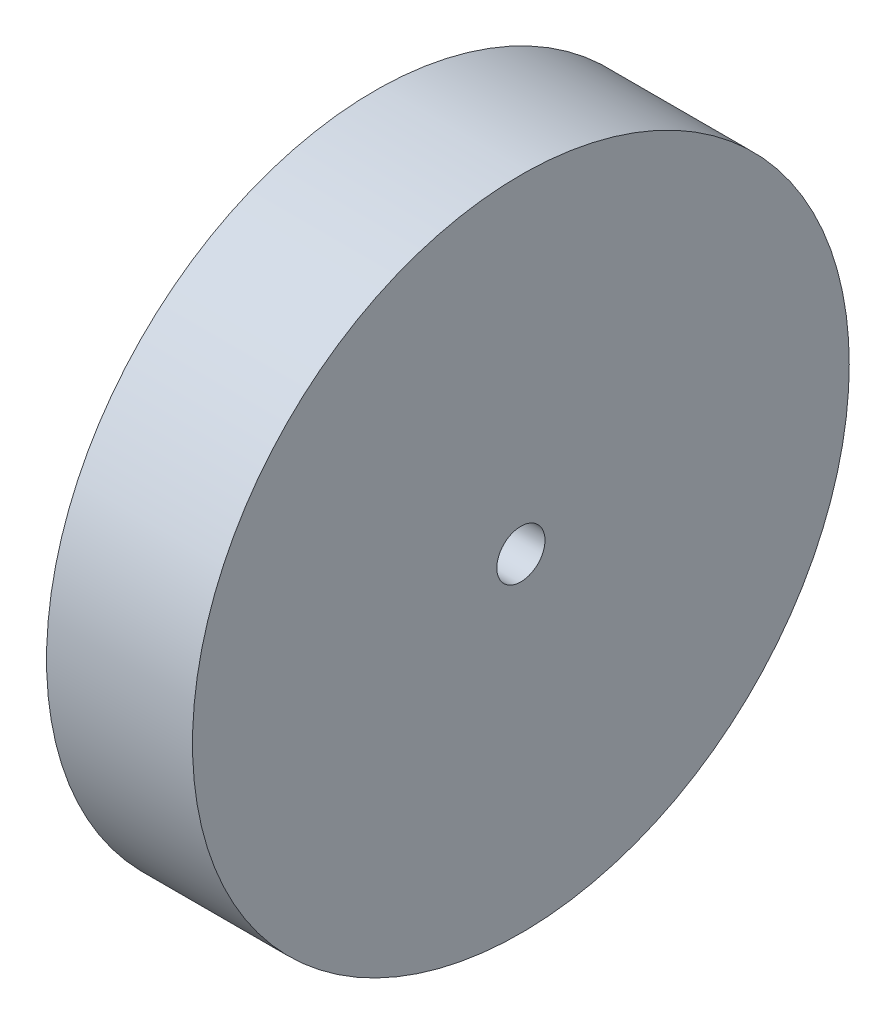
ISO-10303-21;
HEADER;
FILE_DESCRIPTION(('STEP AP214'),'2;1');
FILE_NAME('part.step','',(''),(''),'','','');
FILE_SCHEMA(('AUTOMOTIVE_DESIGN { 1 0 10303 214 1 1 1 1 }'));
ENDSEC;
DATA;
#1=APPLICATION_CONTEXT('core data for automotive mechanical design processes');
#2=APPLICATION_PROTOCOL_DEFINITION('international standard','automotive_design',2000,#1);
#3=PRODUCT_CONTEXT('',#1,'mechanical');
#4=PRODUCT('Part','Part','',(#3));
#5=PRODUCT_RELATED_PRODUCT_CATEGORY('part','',(#4));
#6=PRODUCT_DEFINITION_FORMATION('','',#4);
#7=PRODUCT_DEFINITION_CONTEXT('part definition',#1,'design');
#8=PRODUCT_DEFINITION('design','',#6,#7);
#9=PRODUCT_DEFINITION_SHAPE('','',#8);
#10=(LENGTH_UNIT() NAMED_UNIT(*) SI_UNIT(.MILLI.,.METRE.));
#11=(NAMED_UNIT(*) PLANE_ANGLE_UNIT() SI_UNIT($,.RADIAN.));
#12=(NAMED_UNIT(*) SI_UNIT($,.STERADIAN.) SOLID_ANGLE_UNIT());
#13=UNCERTAINTY_MEASURE_WITH_UNIT(LENGTH_MEASURE(1.E-05),#10,'distance_accuracy_value','');
#14=(GEOMETRIC_REPRESENTATION_CONTEXT(3) GLOBAL_UNCERTAINTY_ASSIGNED_CONTEXT((#13)) GLOBAL_UNIT_ASSIGNED_CONTEXT((#10,
#11,#12)) REPRESENTATION_CONTEXT('',''));
#15=CARTESIAN_POINT('',(0.,0.,0.));
#16=DIRECTION('',(0.,0.,1.));
#17=DIRECTION('',(1.,0.,0.));
#18=AXIS2_PLACEMENT_3D('',#15,#16,#17);
#19=CARTESIAN_POINT('',(16.9333333333333,0.,0.));
#20=DIRECTION('',(-1.,0.,0.));
#21=DIRECTION('',(0.,0.,1.));
#22=AXIS2_PLACEMENT_3D('',#19,#20,#21);
#23=CYLINDRICAL_SURFACE('',#22,38.1);
#24=CARTESIAN_POINT('',(16.9333333333333,0.,0.));
#25=DIRECTION('',(1.,0.,0.));
#26=DIRECTION('',(0.,0.,-1.));
#27=AXIS2_PLACEMENT_3D('',#24,#25,#26);
#28=CIRCLE('',#27,38.1);
#29=CARTESIAN_POINT('',(16.9333333333333,0.,-38.1));
#30=VERTEX_POINT('',#29);
#31=EDGE_CURVE('E10',#30,#30,#28,.T.);
#32=ORIENTED_EDGE('',*,*,#31,.F.);
#33=EDGE_LOOP('',(#32));
#34=FACE_BOUND('',#33,.T.);
#35=CARTESIAN_POINT('',(0.,0.,0.));
#36=DIRECTION('',(1.,0.,0.));
#37=DIRECTION('',(0.,0.,-1.));
#38=AXIS2_PLACEMENT_3D('',#35,#36,#37);
#39=CIRCLE('',#38,38.1);
#40=CARTESIAN_POINT('',(0.,0.,-38.1));
#41=VERTEX_POINT('',#40);
#42=EDGE_CURVE('E36',#41,#41,#39,.T.);
#43=ORIENTED_EDGE('',*,*,#42,.T.);
#44=EDGE_LOOP('',(#43));
#45=FACE_BOUND('',#44,.T.);
#46=ADVANCED_FACE('F33',(#34,#45),#23,.T.);
#47=CARTESIAN_POINT('',(16.9333333333333,0.,0.));
#48=DIRECTION('',(1.,0.,0.));
#49=DIRECTION('',(0.,0.,-1.));
#50=AXIS2_PLACEMENT_3D('',#47,#48,#49);
#51=PLANE('',#50);
#52=CARTESIAN_POINT('',(16.9333333333333,0.,0.));
#53=DIRECTION('',(1.,0.,0.));
#54=DIRECTION('',(0.,0.,-1.));
#55=AXIS2_PLACEMENT_3D('',#52,#53,#54);
#56=CIRCLE('',#55,2.794);
#57=CARTESIAN_POINT('',(16.9333333333333,0.,-2.794));
#58=VERTEX_POINT('',#57);
#59=EDGE_CURVE('E45',#58,#58,#56,.T.);
#60=ORIENTED_EDGE('',*,*,#59,.F.);
#61=EDGE_LOOP('',(#60));
#62=FACE_BOUND('',#61,.T.);
#63=ORIENTED_EDGE('',*,*,#31,.T.);
#64=EDGE_LOOP('',(#63));
#65=FACE_BOUND('',#64,.T.);
#66=ADVANCED_FACE('F60',(#62,#65),#51,.T.);
#67=CARTESIAN_POINT('',(0.,0.,0.));
#68=DIRECTION('',(1.,0.,0.));
#69=DIRECTION('',(0.,0.,-1.));
#70=AXIS2_PLACEMENT_3D('',#67,#68,#69);
#71=PLANE('',#70);
#72=CARTESIAN_POINT('',(0.,0.,0.));
#73=DIRECTION('',(1.,0.,0.));
#74=DIRECTION('',(0.,0.,-1.));
#75=AXIS2_PLACEMENT_3D('',#72,#73,#74);
#76=CIRCLE('',#75,2.794);
#77=CARTESIAN_POINT('',(0.,0.,-2.794));
#78=VERTEX_POINT('',#77);
#79=EDGE_CURVE('E43',#78,#78,#76,.T.);
#80=ORIENTED_EDGE('',*,*,#79,.T.);
#81=EDGE_LOOP('',(#80));
#82=FACE_BOUND('',#81,.T.);
#83=ORIENTED_EDGE('',*,*,#42,.F.);
#84=EDGE_LOOP('',(#83));
#85=FACE_BOUND('',#84,.T.);
#86=ADVANCED_FACE('F51',(#82,#85),#71,.F.);
#87=CARTESIAN_POINT('',(0.,0.,0.));
#88=DIRECTION('',(1.,0.,0.));
#89=DIRECTION('',(0.,0.,-1.));
#90=AXIS2_PLACEMENT_3D('',#87,#88,#89);
#91=CYLINDRICAL_SURFACE('',#90,2.794);
#92=ORIENTED_EDGE('',*,*,#79,.F.);
#93=EDGE_LOOP('',(#92));
#94=FACE_BOUND('',#93,.T.);
#95=ORIENTED_EDGE('',*,*,#59,.T.);
#96=EDGE_LOOP('',(#95));
#97=FACE_BOUND('',#96,.T.);
#98=ADVANCED_FACE('F54',(#94,#97),#91,.F.);
#99=CLOSED_SHELL('',(#46,#66,#86,#98));
#100=MANIFOLD_SOLID_BREP('B2',#99);
#101=ADVANCED_BREP_SHAPE_REPRESENTATION('',(#18,#100),#14);
#102=SHAPE_DEFINITION_REPRESENTATION(#9,#101);
ENDSEC;
END-ISO-10303-21;
